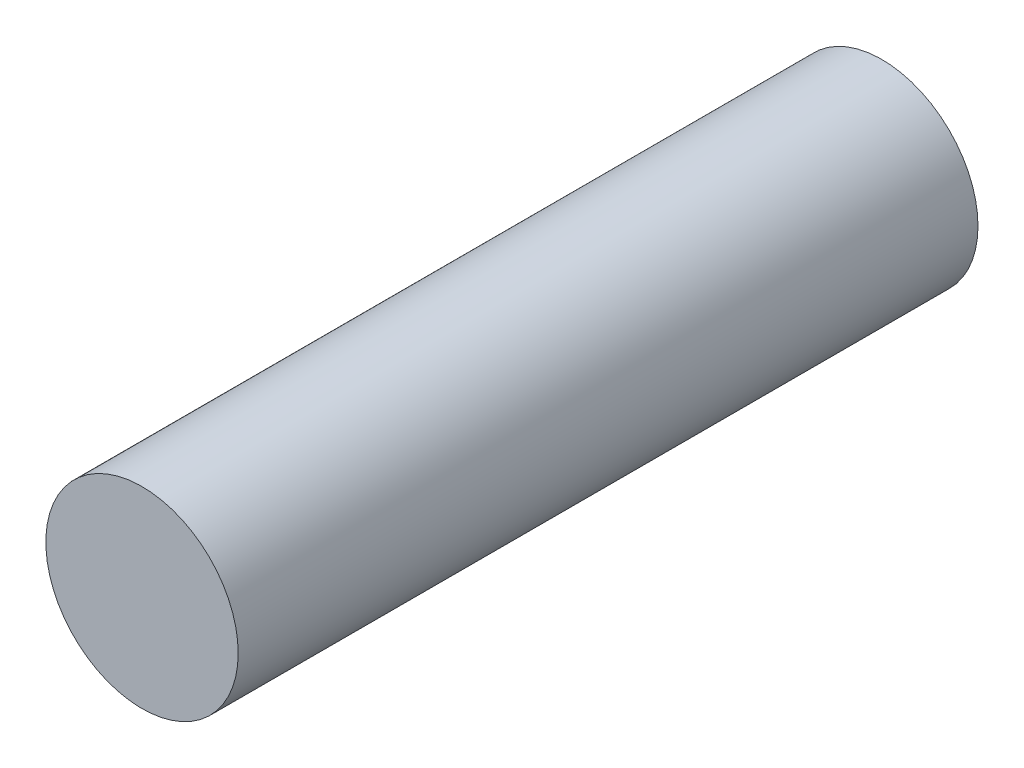
ISO-10303-21;
HEADER;
FILE_DESCRIPTION(('STEP AP214'),'2;1');
FILE_NAME('part.step','',(''),(''),'','','');
FILE_SCHEMA(('AUTOMOTIVE_DESIGN { 1 0 10303 214 1 1 1 1 }'));
ENDSEC;
DATA;
#1=APPLICATION_CONTEXT('core data for automotive mechanical design processes');
#2=APPLICATION_PROTOCOL_DEFINITION('international standard','automotive_design',2000,#1);
#3=PRODUCT_CONTEXT('',#1,'mechanical');
#4=PRODUCT('Part','Part','',(#3));
#5=PRODUCT_RELATED_PRODUCT_CATEGORY('part','',(#4));
#6=PRODUCT_DEFINITION_FORMATION('','',#4);
#7=PRODUCT_DEFINITION_CONTEXT('part definition',#1,'design');
#8=PRODUCT_DEFINITION('design','',#6,#7);
#9=PRODUCT_DEFINITION_SHAPE('','',#8);
#10=(LENGTH_UNIT() NAMED_UNIT(*) SI_UNIT(.MILLI.,.METRE.));
#11=(NAMED_UNIT(*) PLANE_ANGLE_UNIT() SI_UNIT($,.RADIAN.));
#12=(NAMED_UNIT(*) SI_UNIT($,.STERADIAN.) SOLID_ANGLE_UNIT());
#13=UNCERTAINTY_MEASURE_WITH_UNIT(LENGTH_MEASURE(1.E-05),#10,'distance_accuracy_value','');
#14=(GEOMETRIC_REPRESENTATION_CONTEXT(3) GLOBAL_UNCERTAINTY_ASSIGNED_CONTEXT((#13)) GLOBAL_UNIT_ASSIGNED_CONTEXT((#10,
#11,#12)) REPRESENTATION_CONTEXT('',''));
#15=CARTESIAN_POINT('',(0.,0.,0.));
#16=DIRECTION('',(0.,0.,1.));
#17=DIRECTION('',(1.,0.,0.));
#18=AXIS2_PLACEMENT_3D('',#15,#16,#17);
#19=CARTESIAN_POINT('',(0.,0.,25.));
#20=DIRECTION('',(0.,0.,-1.));
#21=DIRECTION('',(-1.,0.,0.));
#22=AXIS2_PLACEMENT_3D('',#19,#20,#21);
#23=CYLINDRICAL_SURFACE('',#22,6.5);
#24=CARTESIAN_POINT('',(0.,0.,25.));
#25=DIRECTION('',(0.,0.,1.));
#26=DIRECTION('',(1.,0.,0.));
#27=AXIS2_PLACEMENT_3D('',#24,#25,#26);
#28=CIRCLE('',#27,6.5);
#29=CARTESIAN_POINT('',(6.5,0.,25.));
#30=VERTEX_POINT('',#29);
#31=EDGE_CURVE('E10',#30,#30,#28,.T.);
#32=ORIENTED_EDGE('',*,*,#31,.F.);
#33=EDGE_LOOP('',(#32));
#34=FACE_BOUND('',#33,.T.);
#35=CARTESIAN_POINT('',(0.,0.,-25.));
#36=DIRECTION('',(0.,0.,1.));
#37=DIRECTION('',(1.,0.,0.));
#38=AXIS2_PLACEMENT_3D('',#35,#36,#37);
#39=CIRCLE('',#38,6.5);
#40=CARTESIAN_POINT('',(6.5,0.,-25.));
#41=VERTEX_POINT('',#40);
#42=EDGE_CURVE('E33',#41,#41,#39,.T.);
#43=ORIENTED_EDGE('',*,*,#42,.T.);
#44=EDGE_LOOP('',(#43));
#45=FACE_BOUND('',#44,.T.);
#46=ADVANCED_FACE('F30',(#34,#45),#23,.T.);
#47=CARTESIAN_POINT('',(0.,0.,25.));
#48=DIRECTION('',(0.,0.,1.));
#49=DIRECTION('',(1.,0.,0.));
#50=AXIS2_PLACEMENT_3D('',#47,#48,#49);
#51=PLANE('',#50);
#52=ORIENTED_EDGE('',*,*,#31,.T.);
#53=EDGE_LOOP('',(#52));
#54=FACE_BOUND('',#53,.T.);
#55=ADVANCED_FACE('F45',(#54),#51,.T.);
#56=CARTESIAN_POINT('',(0.,0.,-25.));
#57=DIRECTION('',(0.,0.,1.));
#58=DIRECTION('',(1.,0.,0.));
#59=AXIS2_PLACEMENT_3D('',#56,#57,#58);
#60=PLANE('',#59);
#61=ORIENTED_EDGE('',*,*,#42,.F.);
#62=EDGE_LOOP('',(#61));
#63=FACE_BOUND('',#62,.T.);
#64=ADVANCED_FACE('F43',(#63),#60,.F.);
#65=CLOSED_SHELL('',(#46,#55,#64));
#66=MANIFOLD_SOLID_BREP('B2',#65);
#67=ADVANCED_BREP_SHAPE_REPRESENTATION('',(#18,#66),#14);
#68=SHAPE_DEFINITION_REPRESENTATION(#9,#67);
ENDSEC;
END-ISO-10303-21;
